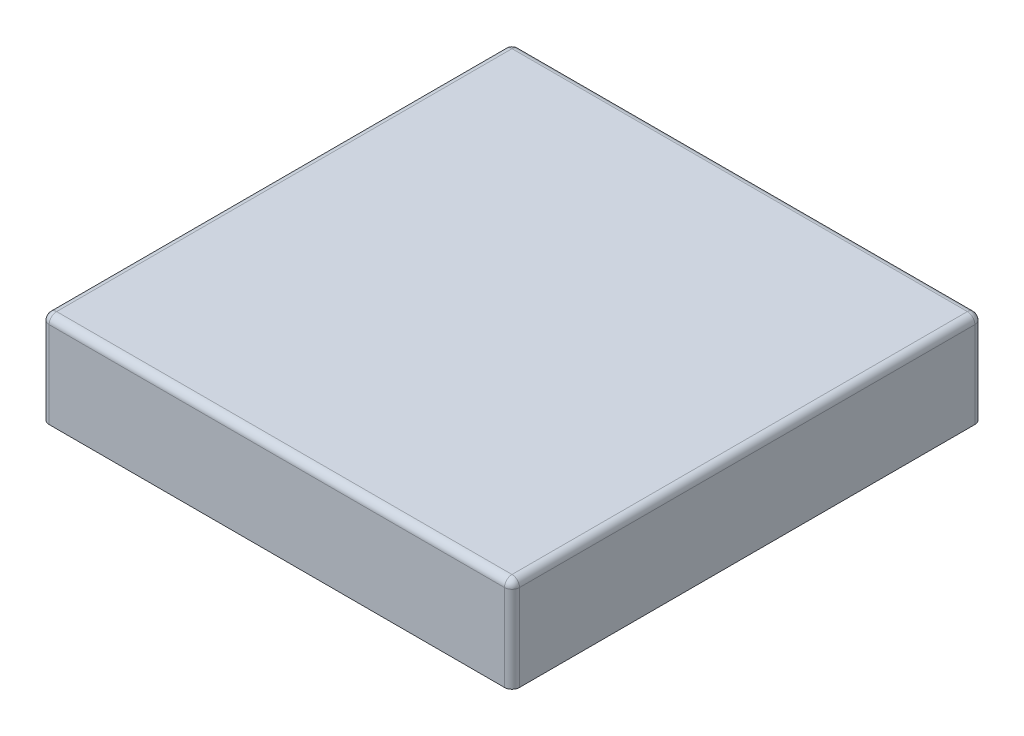
ISO-10303-21;
HEADER;
FILE_DESCRIPTION(('STEP AP214'),'2;1');
FILE_NAME('part.step','',(''),(''),'','','');
FILE_SCHEMA(('AUTOMOTIVE_DESIGN { 1 0 10303 214 1 1 1 1 }'));
ENDSEC;
DATA;
#1=APPLICATION_CONTEXT('core data for automotive mechanical design processes');
#2=APPLICATION_PROTOCOL_DEFINITION('international standard','automotive_design',2000,#1);
#3=PRODUCT_CONTEXT('',#1,'mechanical');
#4=PRODUCT('Part','Part','',(#3));
#5=PRODUCT_RELATED_PRODUCT_CATEGORY('part','',(#4));
#6=PRODUCT_DEFINITION_FORMATION('','',#4);
#7=PRODUCT_DEFINITION_CONTEXT('part definition',#1,'design');
#8=PRODUCT_DEFINITION('design','',#6,#7);
#9=PRODUCT_DEFINITION_SHAPE('','',#8);
#10=(LENGTH_UNIT() NAMED_UNIT(*) SI_UNIT(.MILLI.,.METRE.));
#11=(NAMED_UNIT(*) PLANE_ANGLE_UNIT() SI_UNIT($,.RADIAN.));
#12=(NAMED_UNIT(*) SI_UNIT($,.STERADIAN.) SOLID_ANGLE_UNIT());
#13=UNCERTAINTY_MEASURE_WITH_UNIT(LENGTH_MEASURE(1.E-05),#10,'distance_accuracy_value','');
#14=(GEOMETRIC_REPRESENTATION_CONTEXT(3) GLOBAL_UNCERTAINTY_ASSIGNED_CONTEXT((#13)) GLOBAL_UNIT_ASSIGNED_CONTEXT((#10,
#11,#12)) REPRESENTATION_CONTEXT('',''));
#15=CARTESIAN_POINT('',(0.,0.,0.));
#16=DIRECTION('',(0.,0.,1.));
#17=DIRECTION('',(1.,0.,0.));
#18=AXIS2_PLACEMENT_3D('',#15,#16,#17);
#19=CARTESIAN_POINT('',(0.,0.,0.));
#20=DIRECTION('',(0.,-1.,0.));
#21=DIRECTION('',(0.,0.,-1.));
#22=AXIS2_PLACEMENT_3D('',#19,#20,#21);
#23=PLANE('',#22);
#24=DIRECTION('',(0.,0.,1.));
#25=VECTOR('',#24,1.);
#26=CARTESIAN_POINT('',(-17.7331133805742,0.,7.15160891089113));
#27=LINE('',#26,#25);
#28=CARTESIAN_POINT('',(-17.7331133805742,0.,-8.46939108910887));
#29=VERTEX_POINT('',#28);
#30=CARTESIAN_POINT('',(-17.7331133805742,0.,6.89760891089113));
#31=VERTEX_POINT('',#30);
#32=EDGE_CURVE('E160',#29,#31,#27,.T.);
#33=ORIENTED_EDGE('',*,*,#32,.F.);
#34=CARTESIAN_POINT('',(-17.4791133805742,0.,-8.46939108910887));
#35=DIRECTION('',(0.,-1.,0.));
#36=DIRECTION('',(0.,0.,-1.));
#37=AXIS2_PLACEMENT_3D('',#34,#35,#36);
#38=CIRCLE('',#37,0.254);
#39=CARTESIAN_POINT('',(-17.4791133805742,0.,-8.72339108910887));
#40=VERTEX_POINT('',#39);
#41=EDGE_CURVE('E209',#29,#40,#38,.T.);
#42=ORIENTED_EDGE('',*,*,#41,.T.);
#43=DIRECTION('',(-1.,0.,0.));
#44=VECTOR('',#43,1.);
#45=CARTESIAN_POINT('',(-17.7331133805742,0.,-8.72339108910887));
#46=LINE('',#45,#44);
#47=CARTESIAN_POINT('',(-2.11211338057419,0.,-8.72339108910887));
#48=VERTEX_POINT('',#47);
#49=EDGE_CURVE('E190',#48,#40,#46,.T.);
#50=ORIENTED_EDGE('',*,*,#49,.F.);
#51=CARTESIAN_POINT('',(-2.11211338057419,0.,-8.46939108910887));
#52=DIRECTION('',(0.,-1.,0.));
#53=DIRECTION('',(0.,0.,-1.));
#54=AXIS2_PLACEMENT_3D('',#51,#52,#53);
#55=CIRCLE('',#54,0.254);
#56=CARTESIAN_POINT('',(-1.85811338057419,0.,-8.46939108910887));
#57=VERTEX_POINT('',#56);
#58=EDGE_CURVE('E207',#48,#57,#55,.T.);
#59=ORIENTED_EDGE('',*,*,#58,.T.);
#60=DIRECTION('',(0.,0.,-1.));
#61=VECTOR('',#60,1.);
#62=CARTESIAN_POINT('',(-1.85811338057419,0.,-8.72339108910887));
#63=LINE('',#62,#61);
#64=CARTESIAN_POINT('',(-1.85811338057419,0.,6.89760891089113));
#65=VERTEX_POINT('',#64);
#66=EDGE_CURVE('E187',#65,#57,#63,.T.);
#67=ORIENTED_EDGE('',*,*,#66,.F.);
#68=CARTESIAN_POINT('',(-2.11211338057419,0.,6.89760891089113));
#69=DIRECTION('',(0.,-1.,0.));
#70=DIRECTION('',(0.,0.,-1.));
#71=AXIS2_PLACEMENT_3D('',#68,#69,#70);
#72=CIRCLE('',#71,0.254);
#73=CARTESIAN_POINT('',(-2.11211338057419,0.,7.15160891089113));
#74=VERTEX_POINT('',#73);
#75=EDGE_CURVE('E205',#65,#74,#72,.T.);
#76=ORIENTED_EDGE('',*,*,#75,.T.);
#77=DIRECTION('',(1.,0.,0.));
#78=VECTOR('',#77,1.);
#79=CARTESIAN_POINT('',(-1.85811338057419,0.,7.15160891089113));
#80=LINE('',#79,#78);
#81=CARTESIAN_POINT('',(-17.4791133805742,0.,7.15160891089113));
#82=VERTEX_POINT('',#81);
#83=EDGE_CURVE('E164',#82,#74,#80,.T.);
#84=ORIENTED_EDGE('',*,*,#83,.F.);
#85=CARTESIAN_POINT('',(-17.4791133805742,0.,6.89760891089113));
#86=DIRECTION('',(0.,-1.,0.));
#87=DIRECTION('',(0.,0.,-1.));
#88=AXIS2_PLACEMENT_3D('',#85,#86,#87);
#89=CIRCLE('',#88,0.254);
#90=EDGE_CURVE('E203',#82,#31,#89,.T.);
#91=ORIENTED_EDGE('',*,*,#90,.T.);
#92=EDGE_LOOP('',(#33,#42,#50,#59,#67,#76,#84,#91));
#93=FACE_BOUND('',#92,.T.);
#94=DIRECTION('',(-1.,0.,0.));
#95=VECTOR('',#94,1.);
#96=CARTESIAN_POINT('',(0.,0.,-7.19939108910887));
#97=LINE('',#96,#95);
#98=CARTESIAN_POINT('',(-3.38211338057419,0.,-7.19939108910887));
#99=VERTEX_POINT('',#98);
#100=CARTESIAN_POINT('',(-16.2091133805742,0.,-7.19939108910887));
#101=VERTEX_POINT('',#100);
#102=EDGE_CURVE('E155',#99,#101,#97,.T.);
#103=ORIENTED_EDGE('',*,*,#102,.T.);
#104=DIRECTION('',(0.,0.,1.));
#105=VECTOR('',#104,1.);
#106=CARTESIAN_POINT('',(-16.2091133805742,0.,0.));
#107=LINE('',#106,#105);
#108=CARTESIAN_POINT('',(-16.2091133805742,0.,5.62760891089113));
#109=VERTEX_POINT('',#108);
#110=EDGE_CURVE('E177',#101,#109,#107,.T.);
#111=ORIENTED_EDGE('',*,*,#110,.T.);
#112=DIRECTION('',(1.,0.,0.));
#113=VECTOR('',#112,1.);
#114=CARTESIAN_POINT('',(0.,0.,5.62760891089113));
#115=LINE('',#114,#113);
#116=CARTESIAN_POINT('',(-3.38211338057419,0.,5.62760891089113));
#117=VERTEX_POINT('',#116);
#118=EDGE_CURVE('E159',#109,#117,#115,.T.);
#119=ORIENTED_EDGE('',*,*,#118,.T.);
#120=DIRECTION('',(0.,0.,-1.));
#121=VECTOR('',#120,1.);
#122=CARTESIAN_POINT('',(-3.38211338057419,0.,0.));
#123=LINE('',#122,#121);
#124=EDGE_CURVE('E181',#117,#99,#123,.T.);
#125=ORIENTED_EDGE('',*,*,#124,.T.);
#126=EDGE_LOOP('',(#103,#111,#119,#125));
#127=FACE_BOUND('',#126,.T.);
#128=ADVANCED_FACE('F35',(#93,#127),#23,.T.);
#129=CARTESIAN_POINT('',(-17.7331133805742,3.175,7.15160891089113));
#130=DIRECTION('',(1.,0.,0.));
#131=DIRECTION('',(0.,0.,-1.));
#132=AXIS2_PLACEMENT_3D('',#129,#130,#131);
#133=PLANE('',#132);
#134=DIRECTION('',(0.,0.,1.));
#135=VECTOR('',#134,1.);
#136=CARTESIAN_POINT('',(-17.7331133805742,2.921,7.15160891089113));
#137=LINE('',#136,#135);
#138=CARTESIAN_POINT('',(-17.7331133805742,2.921,6.89760891089113));
#139=VERTEX_POINT('',#138);
#140=CARTESIAN_POINT('',(-17.7331133805742,2.921,-8.46939108910887));
#141=VERTEX_POINT('',#140);
#142=EDGE_CURVE('E198',#139,#141,#137,.F.);
#143=ORIENTED_EDGE('',*,*,#142,.T.);
#144=DIRECTION('',(0.,-1.,0.));
#145=VECTOR('',#144,1.);
#146=CARTESIAN_POINT('',(-17.7331133805742,3.175,-8.46939108910887));
#147=LINE('',#146,#145);
#148=EDGE_CURVE('E200',#141,#29,#147,.T.);
#149=ORIENTED_EDGE('',*,*,#148,.T.);
#150=ORIENTED_EDGE('',*,*,#32,.T.);
#151=DIRECTION('',(0.,-1.,0.));
#152=VECTOR('',#151,1.);
#153=CARTESIAN_POINT('',(-17.7331133805742,3.175,6.89760891089113));
#154=LINE('',#153,#152);
#155=EDGE_CURVE('E196',#31,#139,#154,.F.);
#156=ORIENTED_EDGE('',*,*,#155,.T.);
#157=EDGE_LOOP('',(#143,#149,#150,#156));
#158=FACE_BOUND('',#157,.T.);
#159=ADVANCED_FACE('F304',(#158),#133,.F.);
#160=CARTESIAN_POINT('',(-1.85811338057419,3.175,7.15160891089113));
#161=DIRECTION('',(0.,0.,-1.));
#162=DIRECTION('',(-1.,0.,0.));
#163=AXIS2_PLACEMENT_3D('',#160,#161,#162);
#164=PLANE('',#163);
#165=ORIENTED_EDGE('',*,*,#83,.T.);
#166=DIRECTION('',(0.,-1.,0.));
#167=VECTOR('',#166,1.);
#168=CARTESIAN_POINT('',(-2.11211338057419,3.175,7.15160891089113));
#169=LINE('',#168,#167);
#170=CARTESIAN_POINT('',(-2.11211338057419,2.921,7.15160891089113));
#171=VERTEX_POINT('',#170);
#172=EDGE_CURVE('E227',#74,#171,#169,.F.);
#173=ORIENTED_EDGE('',*,*,#172,.T.);
#174=DIRECTION('',(1.,0.,0.));
#175=VECTOR('',#174,1.);
#176=CARTESIAN_POINT('',(-1.85811338057419,2.921,7.15160891089113));
#177=LINE('',#176,#175);
#178=CARTESIAN_POINT('',(-17.4791133805742,2.921,7.15160891089113));
#179=VERTEX_POINT('',#178);
#180=EDGE_CURVE('E223',#171,#179,#177,.F.);
#181=ORIENTED_EDGE('',*,*,#180,.T.);
#182=DIRECTION('',(0.,-1.,0.));
#183=VECTOR('',#182,1.);
#184=CARTESIAN_POINT('',(-17.4791133805742,3.175,7.15160891089113));
#185=LINE('',#184,#183);
#186=EDGE_CURVE('E225',#179,#82,#185,.T.);
#187=ORIENTED_EDGE('',*,*,#186,.T.);
#188=EDGE_LOOP('',(#165,#173,#181,#187));
#189=FACE_BOUND('',#188,.T.);
#190=ADVANCED_FACE('F310',(#189),#164,.F.);
#191=CARTESIAN_POINT('',(-1.85811338057419,3.175,-8.72339108910887));
#192=DIRECTION('',(-1.,0.,0.));
#193=DIRECTION('',(0.,0.,1.));
#194=AXIS2_PLACEMENT_3D('',#191,#192,#193);
#195=PLANE('',#194);
#196=ORIENTED_EDGE('',*,*,#66,.T.);
#197=DIRECTION('',(0.,-1.,0.));
#198=VECTOR('',#197,1.);
#199=CARTESIAN_POINT('',(-1.85811338057419,3.175,-8.46939108910887));
#200=LINE('',#199,#198);
#201=CARTESIAN_POINT('',(-1.85811338057419,2.921,-8.46939108910887));
#202=VERTEX_POINT('',#201);
#203=EDGE_CURVE('E221',#57,#202,#200,.F.);
#204=ORIENTED_EDGE('',*,*,#203,.T.);
#205=DIRECTION('',(0.,0.,-1.));
#206=VECTOR('',#205,1.);
#207=CARTESIAN_POINT('',(-1.85811338057419,2.921,-8.72339108910887));
#208=LINE('',#207,#206);
#209=CARTESIAN_POINT('',(-1.85811338057419,2.921,6.89760891089113));
#210=VERTEX_POINT('',#209);
#211=EDGE_CURVE('E217',#202,#210,#208,.F.);
#212=ORIENTED_EDGE('',*,*,#211,.T.);
#213=DIRECTION('',(0.,-1.,0.));
#214=VECTOR('',#213,1.);
#215=CARTESIAN_POINT('',(-1.85811338057419,3.175,6.89760891089113));
#216=LINE('',#215,#214);
#217=EDGE_CURVE('E219',#210,#65,#216,.T.);
#218=ORIENTED_EDGE('',*,*,#217,.T.);
#219=EDGE_LOOP('',(#196,#204,#212,#218));
#220=FACE_BOUND('',#219,.T.);
#221=ADVANCED_FACE('F320',(#220),#195,.F.);
#222=CARTESIAN_POINT('',(-17.7331133805742,3.175,-8.72339108910887));
#223=DIRECTION('',(0.,0.,1.));
#224=DIRECTION('',(1.,0.,0.));
#225=AXIS2_PLACEMENT_3D('',#222,#223,#224);
#226=PLANE('',#225);
#227=ORIENTED_EDGE('',*,*,#49,.T.);
#228=DIRECTION('',(0.,-1.,0.));
#229=VECTOR('',#228,1.);
#230=CARTESIAN_POINT('',(-17.4791133805742,3.175,-8.72339108910887));
#231=LINE('',#230,#229);
#232=CARTESIAN_POINT('',(-17.4791133805742,2.921,-8.72339108910887));
#233=VERTEX_POINT('',#232);
#234=EDGE_CURVE('E215',#40,#233,#231,.F.);
#235=ORIENTED_EDGE('',*,*,#234,.T.);
#236=DIRECTION('',(-1.,0.,0.));
#237=VECTOR('',#236,1.);
#238=CARTESIAN_POINT('',(-17.7331133805742,2.921,-8.72339108910887));
#239=LINE('',#238,#237);
#240=CARTESIAN_POINT('',(-2.11211338057419,2.921,-8.72339108910887));
#241=VERTEX_POINT('',#240);
#242=EDGE_CURVE('E211',#233,#241,#239,.F.);
#243=ORIENTED_EDGE('',*,*,#242,.T.);
#244=DIRECTION('',(0.,-1.,0.));
#245=VECTOR('',#244,1.);
#246=CARTESIAN_POINT('',(-2.11211338057419,3.175,-8.72339108910887));
#247=LINE('',#246,#245);
#248=EDGE_CURVE('E213',#241,#48,#247,.T.);
#249=ORIENTED_EDGE('',*,*,#248,.T.);
#250=EDGE_LOOP('',(#227,#235,#243,#249));
#251=FACE_BOUND('',#250,.T.);
#252=ADVANCED_FACE('F317',(#251),#226,.F.);
#253=CARTESIAN_POINT('',(0.,3.175,0.));
#254=DIRECTION('',(0.,-1.,0.));
#255=DIRECTION('',(0.,0.,-1.));
#256=AXIS2_PLACEMENT_3D('',#253,#254,#255);
#257=PLANE('',#256);
#258=DIRECTION('',(1.,0.,0.));
#259=VECTOR('',#258,1.);
#260=CARTESIAN_POINT('',(0.,3.175,6.89760891089113));
#261=LINE('',#260,#259);
#262=CARTESIAN_POINT('',(-17.4791133805742,3.175,6.89760891089113));
#263=VERTEX_POINT('',#262);
#264=CARTESIAN_POINT('',(-2.11211338057419,3.175,6.89760891089113));
#265=VERTEX_POINT('',#264);
#266=EDGE_CURVE('E229',#263,#265,#261,.T.);
#267=ORIENTED_EDGE('',*,*,#266,.T.);
#268=DIRECTION('',(0.,0.,-1.));
#269=VECTOR('',#268,1.);
#270=CARTESIAN_POINT('',(-2.11211338057419,3.175,0.));
#271=LINE('',#270,#269);
#272=CARTESIAN_POINT('',(-2.11211338057419,3.175,-8.46939108910887));
#273=VERTEX_POINT('',#272);
#274=EDGE_CURVE('E11',#265,#273,#271,.T.);
#275=ORIENTED_EDGE('',*,*,#274,.T.);
#276=DIRECTION('',(-1.,0.,0.));
#277=VECTOR('',#276,1.);
#278=CARTESIAN_POINT('',(0.,3.175,-8.46939108910887));
#279=LINE('',#278,#277);
#280=CARTESIAN_POINT('',(-17.4791133805742,3.175,-8.46939108910887));
#281=VERTEX_POINT('',#280);
#282=EDGE_CURVE('E44',#273,#281,#279,.T.);
#283=ORIENTED_EDGE('',*,*,#282,.T.);
#284=DIRECTION('',(0.,0.,1.));
#285=VECTOR('',#284,1.);
#286=CARTESIAN_POINT('',(-17.4791133805742,3.175,0.));
#287=LINE('',#286,#285);
#288=EDGE_CURVE('E231',#281,#263,#287,.T.);
#289=ORIENTED_EDGE('',*,*,#288,.T.);
#290=EDGE_LOOP('',(#267,#275,#283,#289));
#291=FACE_BOUND('',#290,.T.);
#292=ADVANCED_FACE('F316',(#291),#257,.F.);
#293=CARTESIAN_POINT('',(-16.2091133805742,3.175,7.15160891089113));
#294=DIRECTION('',(1.,0.,0.));
#295=DIRECTION('',(0.,0.,-1.));
#296=AXIS2_PLACEMENT_3D('',#293,#294,#295);
#297=PLANE('',#296);
#298=ORIENTED_EDGE('',*,*,#110,.F.);
#299=DIRECTION('',(0.,-1.,0.));
#300=VECTOR('',#299,1.);
#301=CARTESIAN_POINT('',(-16.2091133805742,3.175,-7.19939108910887));
#302=LINE('',#301,#300);
#303=CARTESIAN_POINT('',(-16.2091133805742,1.651,-7.19939108910887));
#304=VERTEX_POINT('',#303);
#305=EDGE_CURVE('E154',#304,#101,#302,.T.);
#306=ORIENTED_EDGE('',*,*,#305,.F.);
#307=DIRECTION('',(0.,0.,1.));
#308=VECTOR('',#307,1.);
#309=CARTESIAN_POINT('',(-16.2091133805742,1.651,0.));
#310=LINE('',#309,#308);
#311=CARTESIAN_POINT('',(-16.2091133805742,1.651,5.62760891089113));
#312=VERTEX_POINT('',#311);
#313=EDGE_CURVE('E140',#304,#312,#310,.T.);
#314=ORIENTED_EDGE('',*,*,#313,.T.);
#315=DIRECTION('',(0.,-1.,0.));
#316=VECTOR('',#315,1.);
#317=CARTESIAN_POINT('',(-16.2091133805742,3.175,5.62760891089113));
#318=LINE('',#317,#316);
#319=EDGE_CURVE('E152',#312,#109,#318,.T.);
#320=ORIENTED_EDGE('',*,*,#319,.T.);
#321=EDGE_LOOP('',(#298,#306,#314,#320));
#322=FACE_BOUND('',#321,.T.);
#323=ADVANCED_FACE('F151',(#322),#297,.T.);
#324=CARTESIAN_POINT('',(-1.85811338057419,3.175,5.62760891089113));
#325=DIRECTION('',(0.,0.,-1.));
#326=DIRECTION('',(-1.,0.,0.));
#327=AXIS2_PLACEMENT_3D('',#324,#325,#326);
#328=PLANE('',#327);
#329=ORIENTED_EDGE('',*,*,#118,.F.);
#330=ORIENTED_EDGE('',*,*,#319,.F.);
#331=DIRECTION('',(1.,0.,0.));
#332=VECTOR('',#331,1.);
#333=CARTESIAN_POINT('',(0.,1.651,5.62760891089113));
#334=LINE('',#333,#332);
#335=CARTESIAN_POINT('',(-3.38211338057419,1.651,5.62760891089113));
#336=VERTEX_POINT('',#335);
#337=EDGE_CURVE('E136',#312,#336,#334,.T.);
#338=ORIENTED_EDGE('',*,*,#337,.T.);
#339=DIRECTION('',(0.,-1.,0.));
#340=VECTOR('',#339,1.);
#341=CARTESIAN_POINT('',(-3.38211338057419,3.175,5.62760891089113));
#342=LINE('',#341,#340);
#343=EDGE_CURVE('E161',#336,#117,#342,.T.);
#344=ORIENTED_EDGE('',*,*,#343,.T.);
#345=EDGE_LOOP('',(#329,#330,#338,#344));
#346=FACE_BOUND('',#345,.T.);
#347=ADVANCED_FACE('F157',(#346),#328,.T.);
#348=CARTESIAN_POINT('',(-3.38211338057419,3.175,-8.72339108910887));
#349=DIRECTION('',(-1.,0.,0.));
#350=DIRECTION('',(0.,0.,1.));
#351=AXIS2_PLACEMENT_3D('',#348,#349,#350);
#352=PLANE('',#351);
#353=ORIENTED_EDGE('',*,*,#124,.F.);
#354=ORIENTED_EDGE('',*,*,#343,.F.);
#355=DIRECTION('',(0.,0.,-1.));
#356=VECTOR('',#355,1.);
#357=CARTESIAN_POINT('',(-3.38211338057419,1.651,0.));
#358=LINE('',#357,#356);
#359=CARTESIAN_POINT('',(-3.38211338057419,1.651,-7.19939108910887));
#360=VERTEX_POINT('',#359);
#361=EDGE_CURVE('E141',#336,#360,#358,.T.);
#362=ORIENTED_EDGE('',*,*,#361,.T.);
#363=DIRECTION('',(0.,-1.,0.));
#364=VECTOR('',#363,1.);
#365=CARTESIAN_POINT('',(-3.38211338057419,3.175,-7.19939108910887));
#366=LINE('',#365,#364);
#367=EDGE_CURVE('E166',#360,#99,#366,.T.);
#368=ORIENTED_EDGE('',*,*,#367,.T.);
#369=EDGE_LOOP('',(#353,#354,#362,#368));
#370=FACE_BOUND('',#369,.T.);
#371=ADVANCED_FACE('F401',(#370),#352,.T.);
#372=CARTESIAN_POINT('',(-17.7331133805742,3.175,-7.19939108910887));
#373=DIRECTION('',(0.,0.,1.));
#374=DIRECTION('',(1.,0.,0.));
#375=AXIS2_PLACEMENT_3D('',#372,#373,#374);
#376=PLANE('',#375);
#377=ORIENTED_EDGE('',*,*,#102,.F.);
#378=ORIENTED_EDGE('',*,*,#367,.F.);
#379=DIRECTION('',(-1.,0.,0.));
#380=VECTOR('',#379,1.);
#381=CARTESIAN_POINT('',(0.,1.651,-7.19939108910887));
#382=LINE('',#381,#380);
#383=EDGE_CURVE('E172',#360,#304,#382,.T.);
#384=ORIENTED_EDGE('',*,*,#383,.T.);
#385=ORIENTED_EDGE('',*,*,#305,.T.);
#386=EDGE_LOOP('',(#377,#378,#384,#385));
#387=FACE_BOUND('',#386,.T.);
#388=ADVANCED_FACE('F301',(#387),#376,.T.);
#389=CARTESIAN_POINT('',(0.,1.651,0.));
#390=DIRECTION('',(0.,-1.,0.));
#391=DIRECTION('',(0.,0.,-1.));
#392=AXIS2_PLACEMENT_3D('',#389,#390,#391);
#393=PLANE('',#392);
#394=CARTESIAN_POINT('',(-9.79561338057419,1.651,-0.785891089108873));
#395=DIRECTION('',(0.,-1.,0.));
#396=DIRECTION('',(0.,0.,-1.));
#397=AXIS2_PLACEMENT_3D('',#394,#395,#396);
#398=CIRCLE('',#397,3.175);
#399=CARTESIAN_POINT('',(-9.79561338057419,1.651,-3.96089108910887));
#400=VERTEX_POINT('',#399);
#401=EDGE_CURVE('E193',#400,#400,#398,.T.);
#402=ORIENTED_EDGE('',*,*,#401,.F.);
#403=EDGE_LOOP('',(#402));
#404=FACE_BOUND('',#403,.T.);
#405=ORIENTED_EDGE('',*,*,#313,.F.);
#406=ORIENTED_EDGE('',*,*,#383,.F.);
#407=ORIENTED_EDGE('',*,*,#361,.F.);
#408=ORIENTED_EDGE('',*,*,#337,.F.);
#409=EDGE_LOOP('',(#405,#406,#407,#408));
#410=FACE_BOUND('',#409,.T.);
#411=ADVANCED_FACE('F138',(#404,#410),#393,.T.);
#412=CARTESIAN_POINT('',(-9.79561338057419,10.6312561210692,-0.785891089108873));
#413=DIRECTION('',(0.,-1.,0.));
#414=DIRECTION('',(0.,0.,-1.));
#415=AXIS2_PLACEMENT_3D('',#412,#413,#414);
#416=CYLINDRICAL_SURFACE('',#415,3.175);
#417=ORIENTED_EDGE('',*,*,#401,.T.);
#418=EDGE_LOOP('',(#417));
#419=FACE_BOUND('',#418,.T.);
#420=CARTESIAN_POINT('',(-9.79561338057419,0.,-0.785891089108873));
#421=DIRECTION('',(0.,-1.,0.));
#422=DIRECTION('',(0.,0.,-1.));
#423=AXIS2_PLACEMENT_3D('',#420,#421,#422);
#424=CIRCLE('',#423,3.175);
#425=CARTESIAN_POINT('',(-9.79561338057419,0.,-3.96089108910887));
#426=VERTEX_POINT('',#425);
#427=EDGE_CURVE('E274',#426,#426,#424,.T.);
#428=ORIENTED_EDGE('',*,*,#427,.F.);
#429=EDGE_LOOP('',(#428));
#430=FACE_BOUND('',#429,.T.);
#431=ADVANCED_FACE('F300',(#419,#430),#416,.T.);
#432=CARTESIAN_POINT('',(-9.79561338057419,0.,-0.785891089108873));
#433=DIRECTION('',(0.,-1.,0.));
#434=DIRECTION('',(0.,0.,-1.));
#435=AXIS2_PLACEMENT_3D('',#432,#433,#434);
#436=PLANE('',#435);
#437=CARTESIAN_POINT('',(-9.79561338057419,0.,-0.785891089108873));
#438=DIRECTION('',(0.,-1.,0.));
#439=DIRECTION('',(0.,0.,-1.));
#440=AXIS2_PLACEMENT_3D('',#437,#438,#439);
#441=CIRCLE('',#440,2.3876);
#442=CARTESIAN_POINT('',(-9.79561338057419,0.,-3.17349108910887));
#443=VERTEX_POINT('',#442);
#444=EDGE_CURVE('E269',#443,#443,#441,.T.);
#445=ORIENTED_EDGE('',*,*,#444,.F.);
#446=EDGE_LOOP('',(#445));
#447=FACE_BOUND('',#446,.T.);
#448=ORIENTED_EDGE('',*,*,#427,.T.);
#449=EDGE_LOOP('',(#448));
#450=FACE_BOUND('',#449,.T.);
#451=ADVANCED_FACE('F295',(#447,#450),#436,.T.);
#452=CARTESIAN_POINT('',(-9.79561338057419,10.6312561210692,-0.785891089108873));
#453=DIRECTION('',(0.,-1.,0.));
#454=DIRECTION('',(0.,0.,-1.));
#455=AXIS2_PLACEMENT_3D('',#452,#453,#454);
#456=CYLINDRICAL_SURFACE('',#455,2.3876);
#457=CARTESIAN_POINT('',(-9.79561338057419,1.651,-0.785891089108873));
#458=DIRECTION('',(0.,-1.,0.));
#459=DIRECTION('',(0.,0.,-1.));
#460=AXIS2_PLACEMENT_3D('',#457,#458,#459);
#461=CIRCLE('',#460,2.3876);
#462=CARTESIAN_POINT('',(-9.79561338057419,1.651,-3.17349108910887));
#463=VERTEX_POINT('',#462);
#464=EDGE_CURVE('E169',#463,#463,#461,.F.);
#465=ORIENTED_EDGE('',*,*,#464,.T.);
#466=EDGE_LOOP('',(#465));
#467=FACE_BOUND('',#466,.T.);
#468=ORIENTED_EDGE('',*,*,#444,.T.);
#469=EDGE_LOOP('',(#468));
#470=FACE_BOUND('',#469,.T.);
#471=ADVANCED_FACE('F284',(#467,#470),#456,.F.);
#472=ORIENTED_EDGE('',*,*,#464,.F.);
#473=EDGE_LOOP('',(#472));
#474=FACE_BOUND('',#473,.T.);
#475=ADVANCED_FACE('F286',(#474),#393,.T.);
#476=CARTESIAN_POINT('',(-2.11211338057419,3.175,6.89760891089113));
#477=DIRECTION('',(0.,-1.,0.));
#478=DIRECTION('',(0.,0.,-1.));
#479=AXIS2_PLACEMENT_3D('',#476,#477,#478);
#480=CYLINDRICAL_SURFACE('',#479,0.254);
#481=CARTESIAN_POINT('',(-2.11211338057419,2.921,6.89760891089113));
#482=DIRECTION('',(0.,1.,0.));
#483=DIRECTION('',(0.,0.,1.));
#484=AXIS2_PLACEMENT_3D('',#481,#482,#483);
#485=CIRCLE('',#484,0.254);
#486=EDGE_CURVE('E39',#171,#210,#485,.T.);
#487=ORIENTED_EDGE('',*,*,#486,.F.);
#488=ORIENTED_EDGE('',*,*,#172,.F.);
#489=ORIENTED_EDGE('',*,*,#75,.F.);
#490=ORIENTED_EDGE('',*,*,#217,.F.);
#491=EDGE_LOOP('',(#487,#488,#489,#490));
#492=FACE_BOUND('',#491,.T.);
#493=ADVANCED_FACE('F37',(#492),#480,.T.);
#494=CARTESIAN_POINT('',(-2.11211338057419,2.921,6.89760891089113));
#495=DIRECTION('',(0.,0.,1.));
#496=DIRECTION('',(1.,0.,0.));
#497=AXIS2_PLACEMENT_3D('',#494,#495,#496);
#498=SPHERICAL_SURFACE('',#497,0.254);
#499=CARTESIAN_POINT('',(-2.11211338057419,2.921,6.89760891089113));
#500=DIRECTION('',(1.,0.,0.));
#501=DIRECTION('',(0.,0.,-1.));
#502=AXIS2_PLACEMENT_3D('',#499,#500,#501);
#503=CIRCLE('',#502,0.254);
#504=EDGE_CURVE('E260',#171,#265,#503,.F.);
#505=ORIENTED_EDGE('',*,*,#504,.F.);
#506=ORIENTED_EDGE('',*,*,#486,.T.);
#507=CARTESIAN_POINT('',(-2.11211338057419,2.921,6.89760891089113));
#508=DIRECTION('',(0.,0.,1.));
#509=DIRECTION('',(1.,0.,0.));
#510=AXIS2_PLACEMENT_3D('',#507,#508,#509);
#511=CIRCLE('',#510,0.254);
#512=EDGE_CURVE('E262',#265,#210,#511,.F.);
#513=ORIENTED_EDGE('',*,*,#512,.F.);
#514=EDGE_LOOP('',(#505,#506,#513));
#515=FACE_BOUND('',#514,.T.);
#516=ADVANCED_FACE('F293',(#515),#498,.T.);
#517=CARTESIAN_POINT('',(-2.11211338057419,3.175,-8.46939108910887));
#518=DIRECTION('',(0.,-1.,0.));
#519=DIRECTION('',(0.,0.,-1.));
#520=AXIS2_PLACEMENT_3D('',#517,#518,#519);
#521=CYLINDRICAL_SURFACE('',#520,0.254);
#522=ORIENTED_EDGE('',*,*,#58,.F.);
#523=ORIENTED_EDGE('',*,*,#248,.F.);
#524=CARTESIAN_POINT('',(-2.11211338057419,2.921,-8.46939108910887));
#525=DIRECTION('',(0.,1.,0.));
#526=DIRECTION('',(0.,0.,1.));
#527=AXIS2_PLACEMENT_3D('',#524,#525,#526);
#528=CIRCLE('',#527,0.254);
#529=EDGE_CURVE('E257',#202,#241,#528,.T.);
#530=ORIENTED_EDGE('',*,*,#529,.F.);
#531=ORIENTED_EDGE('',*,*,#203,.F.);
#532=EDGE_LOOP('',(#522,#523,#530,#531));
#533=FACE_BOUND('',#532,.T.);
#534=ADVANCED_FACE('F362',(#533),#521,.T.);
#535=CARTESIAN_POINT('',(-2.11211338057419,2.921,0.));
#536=DIRECTION('',(0.,0.,-1.));
#537=DIRECTION('',(-1.,0.,0.));
#538=AXIS2_PLACEMENT_3D('',#535,#536,#537);
#539=CYLINDRICAL_SURFACE('',#538,0.254);
#540=ORIENTED_EDGE('',*,*,#512,.T.);
#541=ORIENTED_EDGE('',*,*,#211,.F.);
#542=CARTESIAN_POINT('',(-2.11211338057419,2.921,-8.46939108910887));
#543=DIRECTION('',(0.,0.,-1.));
#544=DIRECTION('',(-1.,0.,0.));
#545=AXIS2_PLACEMENT_3D('',#542,#543,#544);
#546=CIRCLE('',#545,0.254);
#547=EDGE_CURVE('E254',#273,#202,#546,.T.);
#548=ORIENTED_EDGE('',*,*,#547,.F.);
#549=ORIENTED_EDGE('',*,*,#274,.F.);
#550=EDGE_LOOP('',(#540,#541,#548,#549));
#551=FACE_BOUND('',#550,.T.);
#552=ADVANCED_FACE('F358',(#551),#539,.T.);
#553=CARTESIAN_POINT('',(0.,2.921,6.89760891089113));
#554=DIRECTION('',(1.,0.,0.));
#555=DIRECTION('',(0.,0.,-1.));
#556=AXIS2_PLACEMENT_3D('',#553,#554,#555);
#557=CYLINDRICAL_SURFACE('',#556,0.254);
#558=ORIENTED_EDGE('',*,*,#504,.T.);
#559=ORIENTED_EDGE('',*,*,#266,.F.);
#560=CARTESIAN_POINT('',(-17.4791133805742,2.921,6.89760891089113));
#561=DIRECTION('',(-1.,0.,0.));
#562=DIRECTION('',(0.,0.,1.));
#563=AXIS2_PLACEMENT_3D('',#560,#561,#562);
#564=CIRCLE('',#563,0.254);
#565=EDGE_CURVE('E251',#179,#263,#564,.T.);
#566=ORIENTED_EDGE('',*,*,#565,.F.);
#567=ORIENTED_EDGE('',*,*,#180,.F.);
#568=EDGE_LOOP('',(#558,#559,#566,#567));
#569=FACE_BOUND('',#568,.T.);
#570=ADVANCED_FACE('F354',(#569),#557,.T.);
#571=CARTESIAN_POINT('',(-17.4791133805742,3.175,6.89760891089113));
#572=DIRECTION('',(0.,-1.,0.));
#573=DIRECTION('',(0.,0.,-1.));
#574=AXIS2_PLACEMENT_3D('',#571,#572,#573);
#575=CYLINDRICAL_SURFACE('',#574,0.254);
#576=ORIENTED_EDGE('',*,*,#90,.F.);
#577=ORIENTED_EDGE('',*,*,#186,.F.);
#578=CARTESIAN_POINT('',(-17.4791133805742,2.921,6.89760891089113));
#579=DIRECTION('',(0.,1.,0.));
#580=DIRECTION('',(0.,0.,1.));
#581=AXIS2_PLACEMENT_3D('',#578,#579,#580);
#582=CIRCLE('',#581,0.254);
#583=EDGE_CURVE('E248',#139,#179,#582,.T.);
#584=ORIENTED_EDGE('',*,*,#583,.F.);
#585=ORIENTED_EDGE('',*,*,#155,.F.);
#586=EDGE_LOOP('',(#576,#577,#584,#585));
#587=FACE_BOUND('',#586,.T.);
#588=ADVANCED_FACE('F350',(#587),#575,.T.);
#589=CARTESIAN_POINT('',(-2.11211338057419,2.921,-8.46939108910887));
#590=DIRECTION('',(0.,0.,1.));
#591=DIRECTION('',(1.,0.,0.));
#592=AXIS2_PLACEMENT_3D('',#589,#590,#591);
#593=SPHERICAL_SURFACE('',#592,0.254);
#594=ORIENTED_EDGE('',*,*,#547,.T.);
#595=ORIENTED_EDGE('',*,*,#529,.T.);
#596=CARTESIAN_POINT('',(-2.11211338057419,2.921,-8.46939108910887));
#597=DIRECTION('',(1.,0.,0.));
#598=DIRECTION('',(0.,1.,0.));
#599=AXIS2_PLACEMENT_3D('',#596,#597,#598);
#600=CIRCLE('',#599,0.254);
#601=EDGE_CURVE('E246',#273,#241,#600,.F.);
#602=ORIENTED_EDGE('',*,*,#601,.F.);
#603=EDGE_LOOP('',(#594,#595,#602));
#604=FACE_BOUND('',#603,.T.);
#605=ADVANCED_FACE('F346',(#604),#593,.T.);
#606=CARTESIAN_POINT('',(-17.4791133805742,2.921,6.89760891089113));
#607=DIRECTION('',(0.,0.,1.));
#608=DIRECTION('',(1.,0.,0.));
#609=AXIS2_PLACEMENT_3D('',#606,#607,#608);
#610=SPHERICAL_SURFACE('',#609,0.254);
#611=ORIENTED_EDGE('',*,*,#583,.T.);
#612=ORIENTED_EDGE('',*,*,#565,.T.);
#613=CARTESIAN_POINT('',(-17.4791133805742,2.921,6.89760891089113));
#614=DIRECTION('',(0.,0.,1.));
#615=DIRECTION('',(1.,0.,0.));
#616=AXIS2_PLACEMENT_3D('',#613,#614,#615);
#617=CIRCLE('',#616,0.254);
#618=EDGE_CURVE('E243',#139,#263,#617,.F.);
#619=ORIENTED_EDGE('',*,*,#618,.F.);
#620=EDGE_LOOP('',(#611,#612,#619));
#621=FACE_BOUND('',#620,.T.);
#622=ADVANCED_FACE('F343',(#621),#610,.T.);
#623=CARTESIAN_POINT('',(0.,2.921,-8.46939108910887));
#624=DIRECTION('',(-1.,0.,0.));
#625=DIRECTION('',(0.,0.,1.));
#626=AXIS2_PLACEMENT_3D('',#623,#624,#625);
#627=CYLINDRICAL_SURFACE('',#626,0.254);
#628=ORIENTED_EDGE('',*,*,#601,.T.);
#629=ORIENTED_EDGE('',*,*,#242,.F.);
#630=CARTESIAN_POINT('',(-17.4791133805742,2.921,-8.46939108910887));
#631=DIRECTION('',(-1.,0.,0.));
#632=DIRECTION('',(0.,0.,1.));
#633=AXIS2_PLACEMENT_3D('',#630,#631,#632);
#634=CIRCLE('',#633,0.254);
#635=EDGE_CURVE('E240',#281,#233,#634,.T.);
#636=ORIENTED_EDGE('',*,*,#635,.F.);
#637=ORIENTED_EDGE('',*,*,#282,.F.);
#638=EDGE_LOOP('',(#628,#629,#636,#637));
#639=FACE_BOUND('',#638,.T.);
#640=ADVANCED_FACE('F339',(#639),#627,.T.);
#641=CARTESIAN_POINT('',(-17.4791133805742,2.921,0.));
#642=DIRECTION('',(0.,0.,1.));
#643=DIRECTION('',(1.,0.,0.));
#644=AXIS2_PLACEMENT_3D('',#641,#642,#643);
#645=CYLINDRICAL_SURFACE('',#644,0.254);
#646=ORIENTED_EDGE('',*,*,#618,.T.);
#647=ORIENTED_EDGE('',*,*,#288,.F.);
#648=CARTESIAN_POINT('',(-17.4791133805742,2.921,-8.46939108910887));
#649=DIRECTION('',(0.,0.,-1.));
#650=DIRECTION('',(-1.,0.,0.));
#651=AXIS2_PLACEMENT_3D('',#648,#649,#650);
#652=CIRCLE('',#651,0.254);
#653=EDGE_CURVE('E237',#141,#281,#652,.T.);
#654=ORIENTED_EDGE('',*,*,#653,.F.);
#655=ORIENTED_EDGE('',*,*,#142,.F.);
#656=EDGE_LOOP('',(#646,#647,#654,#655));
#657=FACE_BOUND('',#656,.T.);
#658=ADVANCED_FACE('F335',(#657),#645,.T.);
#659=CARTESIAN_POINT('',(-17.4791133805742,2.921,-8.46939108910887));
#660=DIRECTION('',(0.,0.,1.));
#661=DIRECTION('',(1.,0.,0.));
#662=AXIS2_PLACEMENT_3D('',#659,#660,#661);
#663=SPHERICAL_SURFACE('',#662,0.254);
#664=ORIENTED_EDGE('',*,*,#653,.T.);
#665=ORIENTED_EDGE('',*,*,#635,.T.);
#666=CARTESIAN_POINT('',(-17.4791133805742,2.921,-8.46939108910887));
#667=DIRECTION('',(0.,1.,0.));
#668=DIRECTION('',(0.,0.,1.));
#669=AXIS2_PLACEMENT_3D('',#666,#667,#668);
#670=CIRCLE('',#669,0.254);
#671=EDGE_CURVE('E234',#141,#233,#670,.F.);
#672=ORIENTED_EDGE('',*,*,#671,.F.);
#673=EDGE_LOOP('',(#664,#665,#672));
#674=FACE_BOUND('',#673,.T.);
#675=ADVANCED_FACE('F331',(#674),#663,.T.);
#676=CARTESIAN_POINT('',(-17.4791133805742,3.175,-8.46939108910887));
#677=DIRECTION('',(0.,-1.,0.));
#678=DIRECTION('',(0.,0.,-1.));
#679=AXIS2_PLACEMENT_3D('',#676,#677,#678);
#680=CYLINDRICAL_SURFACE('',#679,0.254);
#681=ORIENTED_EDGE('',*,*,#671,.T.);
#682=ORIENTED_EDGE('',*,*,#234,.F.);
#683=ORIENTED_EDGE('',*,*,#41,.F.);
#684=ORIENTED_EDGE('',*,*,#148,.F.);
#685=EDGE_LOOP('',(#681,#682,#683,#684));
#686=FACE_BOUND('',#685,.T.);
#687=ADVANCED_FACE('F328',(#686),#680,.T.);
#688=CLOSED_SHELL('',(#128,#159,#190,#221,#252,#292,#323,#347,#371,#388,#411,#431,#451,#471,
#475,#493,#516,#534,#552,#570,#588,#605,#622,#640,#658,#675,#687));
#689=MANIFOLD_SOLID_BREP('B2',#688);
#690=ADVANCED_BREP_SHAPE_REPRESENTATION('',(#18,#689),#14);
#691=SHAPE_DEFINITION_REPRESENTATION(#9,#690);
ENDSEC;
END-ISO-10303-21;
